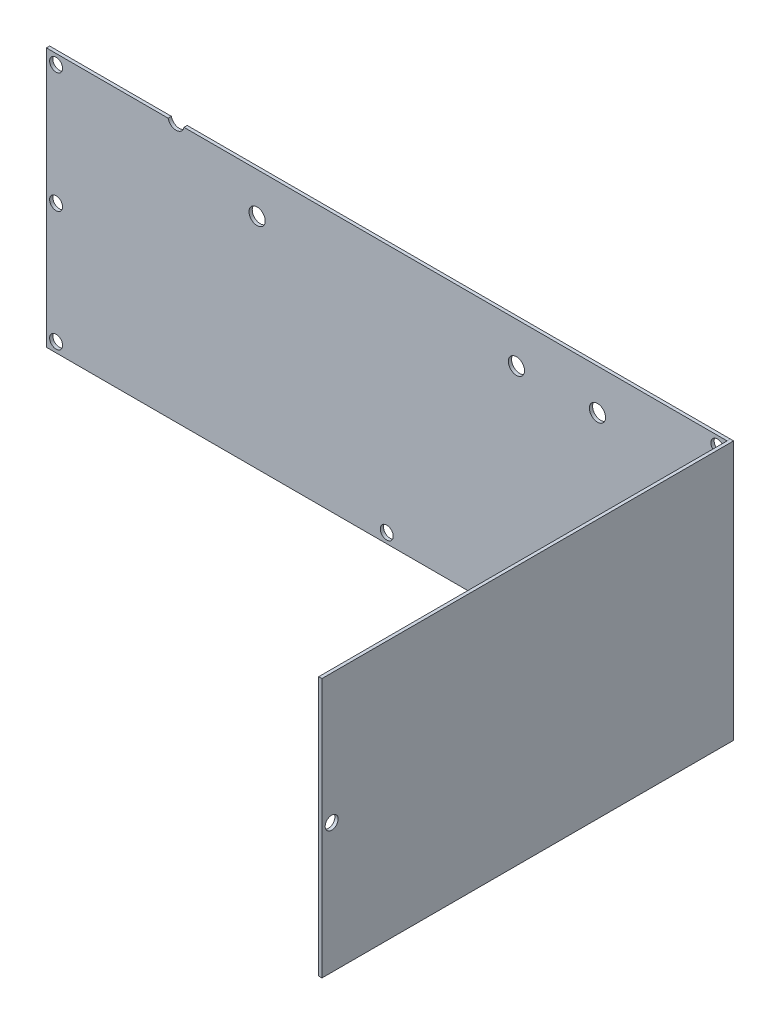
ISO-10303-21;
HEADER;
FILE_DESCRIPTION(('STEP AP214'),'2;1');
FILE_NAME('part.step','',(''),(''),'','','');
FILE_SCHEMA(('AUTOMOTIVE_DESIGN { 1 0 10303 214 1 1 1 1 }'));
ENDSEC;
DATA;
#1=APPLICATION_CONTEXT('core data for automotive mechanical design processes');
#2=APPLICATION_PROTOCOL_DEFINITION('international standard','automotive_design',2000,#1);
#3=PRODUCT_CONTEXT('',#1,'mechanical');
#4=PRODUCT('Part','Part','',(#3));
#5=PRODUCT_RELATED_PRODUCT_CATEGORY('part','',(#4));
#6=PRODUCT_DEFINITION_FORMATION('','',#4);
#7=PRODUCT_DEFINITION_CONTEXT('part definition',#1,'design');
#8=PRODUCT_DEFINITION('design','',#6,#7);
#9=PRODUCT_DEFINITION_SHAPE('','',#8);
#10=(LENGTH_UNIT() NAMED_UNIT(*) SI_UNIT(.MILLI.,.METRE.));
#11=(NAMED_UNIT(*) PLANE_ANGLE_UNIT() SI_UNIT($,.RADIAN.));
#12=(NAMED_UNIT(*) SI_UNIT($,.STERADIAN.) SOLID_ANGLE_UNIT());
#13=UNCERTAINTY_MEASURE_WITH_UNIT(LENGTH_MEASURE(1.E-05),#10,'distance_accuracy_value','');
#14=(GEOMETRIC_REPRESENTATION_CONTEXT(3) GLOBAL_UNCERTAINTY_ASSIGNED_CONTEXT((#13)) GLOBAL_UNIT_ASSIGNED_CONTEXT((#10,
#11,#12)) REPRESENTATION_CONTEXT('',''));
#15=CARTESIAN_POINT('',(0.,0.,0.));
#16=DIRECTION('',(0.,0.,1.));
#17=DIRECTION('',(1.,0.,0.));
#18=AXIS2_PLACEMENT_3D('',#15,#16,#17);
#19=CARTESIAN_POINT('',(105.,40.,0.));
#20=DIRECTION('',(-1.,0.,0.));
#21=DIRECTION('',(0.,-1.,0.));
#22=AXIS2_PLACEMENT_3D('',#19,#20,#21);
#23=PLANE('',#22);
#24=CARTESIAN_POINT('',(105.,0.,124.));
#25=DIRECTION('',(-1.,0.,0.));
#26=DIRECTION('',(0.,-1.,0.));
#27=AXIS2_PLACEMENT_3D('',#24,#25,#26);
#28=CIRCLE('',#27,2.);
#29=CARTESIAN_POINT('',(105.,-2.00000000000003,124.));
#30=VERTEX_POINT('',#29);
#31=EDGE_CURVE('E101',#30,#30,#28,.T.);
#32=ORIENTED_EDGE('',*,*,#31,.F.);
#33=EDGE_LOOP('',(#32));
#34=FACE_BOUND('',#33,.T.);
#35=DIRECTION('',(0.,0.,1.));
#36=VECTOR('',#35,1.);
#37=CARTESIAN_POINT('',(105.,-40.,0.));
#38=LINE('',#37,#36);
#39=CARTESIAN_POINT('',(105.,-40.,0.));
#40=VERTEX_POINT('',#39);
#41=CARTESIAN_POINT('',(105.,-40.,127.));
#42=VERTEX_POINT('',#41);
#43=EDGE_CURVE('E46',#40,#42,#38,.T.);
#44=ORIENTED_EDGE('',*,*,#43,.T.);
#45=DIRECTION('',(0.,-1.,0.));
#46=VECTOR('',#45,1.);
#47=CARTESIAN_POINT('',(105.,40.,127.));
#48=LINE('',#47,#46);
#49=CARTESIAN_POINT('',(105.,40.,127.));
#50=VERTEX_POINT('',#49);
#51=EDGE_CURVE('E83',#50,#42,#48,.T.);
#52=ORIENTED_EDGE('',*,*,#51,.F.);
#53=DIRECTION('',(0.,0.,1.));
#54=VECTOR('',#53,1.);
#55=CARTESIAN_POINT('',(105.,40.,0.));
#56=LINE('',#55,#54);
#57=CARTESIAN_POINT('',(105.,40.,0.));
#58=VERTEX_POINT('',#57);
#59=EDGE_CURVE('E12',#58,#50,#56,.T.);
#60=ORIENTED_EDGE('',*,*,#59,.F.);
#61=DIRECTION('',(0.,-1.,0.));
#62=VECTOR('',#61,1.);
#63=CARTESIAN_POINT('',(105.,40.,0.));
#64=LINE('',#63,#62);
#65=EDGE_CURVE('E84',#58,#40,#64,.T.);
#66=ORIENTED_EDGE('',*,*,#65,.T.);
#67=EDGE_LOOP('',(#44,#52,#60,#66));
#68=FACE_BOUND('',#67,.T.);
#69=ADVANCED_FACE('F43',(#34,#68),#23,.T.);
#70=CARTESIAN_POINT('',(105.,40.,0.));
#71=DIRECTION('',(0.,1.,0.));
#72=DIRECTION('',(0.,0.,1.));
#73=AXIS2_PLACEMENT_3D('',#70,#71,#72);
#74=PLANE('',#73);
#75=ORIENTED_EDGE('',*,*,#59,.T.);
#76=DIRECTION('',(-1.,0.,0.));
#77=VECTOR('',#76,1.);
#78=CARTESIAN_POINT('',(105.,40.,127.));
#79=LINE('',#78,#77);
#80=CARTESIAN_POINT('',(106.,40.,127.));
#81=VERTEX_POINT('',#80);
#82=EDGE_CURVE('E100',#81,#50,#79,.T.);
#83=ORIENTED_EDGE('',*,*,#82,.F.);
#84=DIRECTION('',(0.,0.,1.));
#85=VECTOR('',#84,1.);
#86=CARTESIAN_POINT('',(106.,40.,0.));
#87=LINE('',#86,#85);
#88=CARTESIAN_POINT('',(106.,40.,0.));
#89=VERTEX_POINT('',#88);
#90=EDGE_CURVE('E51',#89,#81,#87,.T.);
#91=ORIENTED_EDGE('',*,*,#90,.F.);
#92=DIRECTION('',(-1.,0.,0.));
#93=VECTOR('',#92,1.);
#94=CARTESIAN_POINT('',(105.,40.,0.));
#95=LINE('',#94,#93);
#96=EDGE_CURVE('E89',#89,#58,#95,.T.);
#97=ORIENTED_EDGE('',*,*,#96,.T.);
#98=EDGE_LOOP('',(#75,#83,#91,#97));
#99=FACE_BOUND('',#98,.T.);
#100=ADVANCED_FACE('F120',(#99),#74,.T.);
#101=CARTESIAN_POINT('',(106.,40.,0.));
#102=DIRECTION('',(1.,0.,0.));
#103=DIRECTION('',(0.,0.,-1.));
#104=AXIS2_PLACEMENT_3D('',#101,#102,#103);
#105=PLANE('',#104);
#106=CARTESIAN_POINT('',(106.,0.,124.));
#107=DIRECTION('',(1.,0.,0.));
#108=DIRECTION('',(0.,1.,0.));
#109=AXIS2_PLACEMENT_3D('',#106,#107,#108);
#110=CIRCLE('',#109,2.);
#111=CARTESIAN_POINT('',(106.,1.99999999999996,124.));
#112=VERTEX_POINT('',#111);
#113=EDGE_CURVE('E104',#112,#112,#110,.T.);
#114=ORIENTED_EDGE('',*,*,#113,.F.);
#115=EDGE_LOOP('',(#114));
#116=FACE_BOUND('',#115,.T.);
#117=ORIENTED_EDGE('',*,*,#90,.T.);
#118=DIRECTION('',(0.,1.,0.));
#119=VECTOR('',#118,1.);
#120=CARTESIAN_POINT('',(106.,40.,127.));
#121=LINE('',#120,#119);
#122=CARTESIAN_POINT('',(106.,-40.,127.));
#123=VERTEX_POINT('',#122);
#124=EDGE_CURVE('E96',#123,#81,#121,.T.);
#125=ORIENTED_EDGE('',*,*,#124,.F.);
#126=DIRECTION('',(0.,0.,1.));
#127=VECTOR('',#126,1.);
#128=CARTESIAN_POINT('',(106.,-40.,0.));
#129=LINE('',#128,#127);
#130=CARTESIAN_POINT('',(106.,-40.,0.));
#131=VERTEX_POINT('',#130);
#132=EDGE_CURVE('E88',#131,#123,#129,.T.);
#133=ORIENTED_EDGE('',*,*,#132,.F.);
#134=DIRECTION('',(0.,1.,0.));
#135=VECTOR('',#134,1.);
#136=CARTESIAN_POINT('',(106.,40.,0.));
#137=LINE('',#136,#135);
#138=EDGE_CURVE('E113',#131,#89,#137,.T.);
#139=ORIENTED_EDGE('',*,*,#138,.T.);
#140=EDGE_LOOP('',(#117,#125,#133,#139));
#141=FACE_BOUND('',#140,.T.);
#142=ADVANCED_FACE('F117',(#116,#141),#105,.T.);
#143=CARTESIAN_POINT('',(105.,-40.,0.));
#144=DIRECTION('',(0.,-1.,0.));
#145=DIRECTION('',(0.,0.,-1.));
#146=AXIS2_PLACEMENT_3D('',#143,#144,#145);
#147=PLANE('',#146);
#148=ORIENTED_EDGE('',*,*,#132,.T.);
#149=DIRECTION('',(1.,0.,0.));
#150=VECTOR('',#149,1.);
#151=CARTESIAN_POINT('',(105.,-40.,127.));
#152=LINE('',#151,#150);
#153=EDGE_CURVE('E91',#42,#123,#152,.T.);
#154=ORIENTED_EDGE('',*,*,#153,.F.);
#155=ORIENTED_EDGE('',*,*,#43,.F.);
#156=DIRECTION('',(1.,0.,0.));
#157=VECTOR('',#156,1.);
#158=CARTESIAN_POINT('',(105.,-40.,0.));
#159=LINE('',#158,#157);
#160=EDGE_CURVE('E111',#40,#131,#159,.T.);
#161=ORIENTED_EDGE('',*,*,#160,.T.);
#162=EDGE_LOOP('',(#148,#154,#155,#161));
#163=FACE_BOUND('',#162,.T.);
#164=ADVANCED_FACE('F92',(#163),#147,.T.);
#165=CARTESIAN_POINT('',(0.,0.,0.));
#166=DIRECTION('',(0.,0.,1.));
#167=DIRECTION('',(1.,0.,0.));
#168=AXIS2_PLACEMENT_3D('',#165,#166,#167);
#169=PLANE('',#168);
#170=ORIENTED_EDGE('',*,*,#65,.F.);
#171=ORIENTED_EDGE('',*,*,#96,.F.);
#172=ORIENTED_EDGE('',*,*,#138,.F.);
#173=ORIENTED_EDGE('',*,*,#160,.F.);
#174=EDGE_LOOP('',(#170,#171,#172,#173));
#175=FACE_BOUND('',#174,.T.);
#176=ADVANCED_FACE('F122',(#175),#169,.F.);
#177=CARTESIAN_POINT('',(0.,0.,127.));
#178=DIRECTION('',(0.,0.,1.));
#179=DIRECTION('',(1.,0.,0.));
#180=AXIS2_PLACEMENT_3D('',#177,#178,#179);
#181=PLANE('',#180);
#182=ORIENTED_EDGE('',*,*,#51,.T.);
#183=ORIENTED_EDGE('',*,*,#153,.T.);
#184=ORIENTED_EDGE('',*,*,#124,.T.);
#185=ORIENTED_EDGE('',*,*,#82,.T.);
#186=EDGE_LOOP('',(#182,#183,#184,#185));
#187=FACE_BOUND('',#186,.T.);
#188=ADVANCED_FACE('F99',(#187),#181,.T.);
#189=CARTESIAN_POINT('',(104.,0.,124.));
#190=DIRECTION('',(1.,0.,0.));
#191=DIRECTION('',(0.,1.,0.));
#192=AXIS2_PLACEMENT_3D('',#189,#190,#191);
#193=CYLINDRICAL_SURFACE('',#192,2.);
#194=ORIENTED_EDGE('',*,*,#31,.T.);
#195=EDGE_LOOP('',(#194));
#196=FACE_BOUND('',#195,.T.);
#197=ORIENTED_EDGE('',*,*,#113,.T.);
#198=EDGE_LOOP('',(#197));
#199=FACE_BOUND('',#198,.T.);
#200=ADVANCED_FACE('F129',(#196,#199),#193,.F.);
#201=CLOSED_SHELL('',(#69,#100,#142,#164,#176,#188,#200));
#202=MANIFOLD_SOLID_BREP('B2',#201);
#203=CARTESIAN_POINT('',(-105.,40.,1.));
#204=DIRECTION('',(0.,-1.,0.));
#205=DIRECTION('',(0.,0.,-1.));
#206=AXIS2_PLACEMENT_3D('',#203,#204,#205);
#207=PLANE('',#206);
#208=DIRECTION('',(-1.,0.,0.));
#209=VECTOR('',#208,1.);
#210=CARTESIAN_POINT('',(-105.,40.,1.));
#211=LINE('',#210,#209);
#212=CARTESIAN_POINT('',(-67.4494897427832,40.,1.));
#213=VERTEX_POINT('',#212);
#214=CARTESIAN_POINT('',(-105.,40.,1.));
#215=VERTEX_POINT('',#214);
#216=EDGE_CURVE('E212',#213,#215,#211,.T.);
#217=ORIENTED_EDGE('',*,*,#216,.F.);
#218=DIRECTION('',(0.,0.,-1.));
#219=VECTOR('',#218,1.);
#220=CARTESIAN_POINT('',(-67.4494897427832,40.,2.));
#221=LINE('',#220,#219);
#222=CARTESIAN_POINT('',(-67.4494897427832,40.,0.));
#223=VERTEX_POINT('',#222);
#224=EDGE_CURVE('E250',#213,#223,#221,.T.);
#225=ORIENTED_EDGE('',*,*,#224,.T.);
#226=DIRECTION('',(-1.,0.,0.));
#227=VECTOR('',#226,1.);
#228=CARTESIAN_POINT('',(-105.,40.,0.));
#229=LINE('',#228,#227);
#230=CARTESIAN_POINT('',(-105.,40.,0.));
#231=VERTEX_POINT('',#230);
#232=EDGE_CURVE('E234',#223,#231,#229,.T.);
#233=ORIENTED_EDGE('',*,*,#232,.T.);
#234=DIRECTION('',(0.,0.,-1.));
#235=VECTOR('',#234,1.);
#236=CARTESIAN_POINT('',(-105.,40.,1.));
#237=LINE('',#236,#235);
#238=EDGE_CURVE('E271',#215,#231,#237,.T.);
#239=ORIENTED_EDGE('',*,*,#238,.F.);
#240=EDGE_LOOP('',(#217,#225,#233,#239));
#241=FACE_BOUND('',#240,.T.);
#242=ADVANCED_FACE('F188',(#241),#207,.F.);
#243=CARTESIAN_POINT('',(-105.,-40.,1.));
#244=DIRECTION('',(1.,0.,0.));
#245=DIRECTION('',(0.,0.,-1.));
#246=AXIS2_PLACEMENT_3D('',#243,#244,#245);
#247=PLANE('',#246);
#248=DIRECTION('',(0.,-1.,0.));
#249=VECTOR('',#248,1.);
#250=CARTESIAN_POINT('',(-105.,-40.,0.));
#251=LINE('',#250,#249);
#252=CARTESIAN_POINT('',(-105.,-40.,0.));
#253=VERTEX_POINT('',#252);
#254=EDGE_CURVE('E262',#231,#253,#251,.T.);
#255=ORIENTED_EDGE('',*,*,#254,.T.);
#256=DIRECTION('',(0.,0.,-1.));
#257=VECTOR('',#256,1.);
#258=CARTESIAN_POINT('',(-105.,-40.,1.));
#259=LINE('',#258,#257);
#260=CARTESIAN_POINT('',(-105.,-40.,1.));
#261=VERTEX_POINT('',#260);
#262=EDGE_CURVE('E41',#261,#253,#259,.T.);
#263=ORIENTED_EDGE('',*,*,#262,.F.);
#264=DIRECTION('',(0.,-1.,0.));
#265=VECTOR('',#264,1.);
#266=CARTESIAN_POINT('',(-105.,-40.,1.));
#267=LINE('',#266,#265);
#268=EDGE_CURVE('E266',#215,#261,#267,.T.);
#269=ORIENTED_EDGE('',*,*,#268,.F.);
#270=ORIENTED_EDGE('',*,*,#238,.T.);
#271=EDGE_LOOP('',(#255,#263,#269,#270));
#272=FACE_BOUND('',#271,.T.);
#273=ADVANCED_FACE('F190',(#272),#247,.F.);
#274=CARTESIAN_POINT('',(-105.,-40.,1.));
#275=DIRECTION('',(0.,1.,0.));
#276=DIRECTION('',(0.,0.,1.));
#277=AXIS2_PLACEMENT_3D('',#274,#275,#276);
#278=PLANE('',#277);
#279=DIRECTION('',(1.,0.,0.));
#280=VECTOR('',#279,1.);
#281=CARTESIAN_POINT('',(-105.,-40.,0.));
#282=LINE('',#281,#280);
#283=CARTESIAN_POINT('',(105.,-40.,0.));
#284=VERTEX_POINT('',#283);
#285=EDGE_CURVE('E267',#253,#284,#282,.T.);
#286=ORIENTED_EDGE('',*,*,#285,.T.);
#287=DIRECTION('',(0.,0.,-1.));
#288=VECTOR('',#287,1.);
#289=CARTESIAN_POINT('',(105.,-40.,1.));
#290=LINE('',#289,#288);
#291=CARTESIAN_POINT('',(105.,-40.,1.));
#292=VERTEX_POINT('',#291);
#293=EDGE_CURVE('E196',#292,#284,#290,.T.);
#294=ORIENTED_EDGE('',*,*,#293,.F.);
#295=DIRECTION('',(1.,0.,0.));
#296=VECTOR('',#295,1.);
#297=CARTESIAN_POINT('',(-105.,-40.,1.));
#298=LINE('',#297,#296);
#299=EDGE_CURVE('E241',#261,#292,#298,.T.);
#300=ORIENTED_EDGE('',*,*,#299,.F.);
#301=ORIENTED_EDGE('',*,*,#262,.T.);
#302=EDGE_LOOP('',(#286,#294,#300,#301));
#303=FACE_BOUND('',#302,.T.);
#304=ADVANCED_FACE('F292',(#303),#278,.F.);
#305=CARTESIAN_POINT('',(105.,-40.,1.));
#306=DIRECTION('',(-1.,0.,0.));
#307=DIRECTION('',(0.,-1.,0.));
#308=AXIS2_PLACEMENT_3D('',#305,#306,#307);
#309=PLANE('',#308);
#310=DIRECTION('',(0.,1.,0.));
#311=VECTOR('',#310,1.);
#312=CARTESIAN_POINT('',(105.,-40.,0.));
#313=LINE('',#312,#311);
#314=CARTESIAN_POINT('',(105.,40.,0.));
#315=VERTEX_POINT('',#314);
#316=EDGE_CURVE('E264',#284,#315,#313,.T.);
#317=ORIENTED_EDGE('',*,*,#316,.T.);
#318=DIRECTION('',(0.,0.,-1.));
#319=VECTOR('',#318,1.);
#320=CARTESIAN_POINT('',(105.,40.,1.));
#321=LINE('',#320,#319);
#322=CARTESIAN_POINT('',(105.,40.,1.));
#323=VERTEX_POINT('',#322);
#324=EDGE_CURVE('E273',#323,#315,#321,.T.);
#325=ORIENTED_EDGE('',*,*,#324,.F.);
#326=DIRECTION('',(0.,1.,0.));
#327=VECTOR('',#326,1.);
#328=CARTESIAN_POINT('',(105.,-40.,1.));
#329=LINE('',#328,#327);
#330=EDGE_CURVE('E282',#292,#323,#329,.T.);
#331=ORIENTED_EDGE('',*,*,#330,.F.);
#332=ORIENTED_EDGE('',*,*,#293,.T.);
#333=EDGE_LOOP('',(#317,#325,#331,#332));
#334=FACE_BOUND('',#333,.T.);
#335=ADVANCED_FACE('F280',(#334),#309,.F.);
#336=CARTESIAN_POINT('',(-62.5505102572168,40.,0.));
#337=VERTEX_POINT('',#336);
#338=EDGE_CURVE('E263',#315,#337,#229,.T.);
#339=ORIENTED_EDGE('',*,*,#338,.T.);
#340=DIRECTION('',(0.,0.,-1.));
#341=VECTOR('',#340,1.);
#342=CARTESIAN_POINT('',(-62.5505102572168,40.,2.));
#343=LINE('',#342,#341);
#344=CARTESIAN_POINT('',(-62.5505102572168,40.,1.));
#345=VERTEX_POINT('',#344);
#346=EDGE_CURVE('E203',#337,#345,#343,.F.);
#347=ORIENTED_EDGE('',*,*,#346,.T.);
#348=EDGE_CURVE('E274',#323,#345,#211,.T.);
#349=ORIENTED_EDGE('',*,*,#348,.F.);
#350=ORIENTED_EDGE('',*,*,#324,.T.);
#351=EDGE_LOOP('',(#339,#347,#349,#350));
#352=FACE_BOUND('',#351,.T.);
#353=ADVANCED_FACE('F284',(#352),#207,.F.);
#354=CARTESIAN_POINT('',(0.,0.,1.));
#355=DIRECTION('',(0.,0.,-1.));
#356=DIRECTION('',(-1.,0.,0.));
#357=AXIS2_PLACEMENT_3D('',#354,#355,#356);
#358=PLANE('',#357);
#359=CARTESIAN_POINT('',(-40.,27.5,1.));
#360=DIRECTION('',(0.,0.,-1.));
#361=DIRECTION('',(-1.,0.,0.));
#362=AXIS2_PLACEMENT_3D('',#359,#360,#361);
#363=CIRCLE('',#362,2.5);
#364=CARTESIAN_POINT('',(-42.5,27.5,1.));
#365=VERTEX_POINT('',#364);
#366=EDGE_CURVE('E345',#365,#365,#363,.T.);
#367=ORIENTED_EDGE('',*,*,#366,.T.);
#368=EDGE_LOOP('',(#367));
#369=FACE_BOUND('',#368,.T.);
#370=CARTESIAN_POINT('',(40.,27.5,1.));
#371=DIRECTION('',(0.,0.,-1.));
#372=DIRECTION('',(-1.,0.,0.));
#373=AXIS2_PLACEMENT_3D('',#370,#371,#372);
#374=CIRCLE('',#373,2.5);
#375=CARTESIAN_POINT('',(37.5,27.5,1.));
#376=VERTEX_POINT('',#375);
#377=EDGE_CURVE('E339',#376,#376,#374,.T.);
#378=ORIENTED_EDGE('',*,*,#377,.T.);
#379=EDGE_LOOP('',(#378));
#380=FACE_BOUND('',#379,.T.);
#381=CARTESIAN_POINT('',(65.,27.5,1.));
#382=DIRECTION('',(0.,0.,-1.));
#383=DIRECTION('',(-1.,0.,0.));
#384=AXIS2_PLACEMENT_3D('',#381,#382,#383);
#385=CIRCLE('',#384,2.49999999999999);
#386=CARTESIAN_POINT('',(62.5,27.5,1.));
#387=VERTEX_POINT('',#386);
#388=EDGE_CURVE('E333',#387,#387,#385,.T.);
#389=ORIENTED_EDGE('',*,*,#388,.T.);
#390=EDGE_LOOP('',(#389));
#391=FACE_BOUND('',#390,.T.);
#392=CARTESIAN_POINT('',(102.,-37.,1.));
#393=DIRECTION('',(0.,0.,-1.));
#394=DIRECTION('',(-1.,0.,0.));
#395=AXIS2_PLACEMENT_3D('',#392,#393,#394);
#396=CIRCLE('',#395,2.);
#397=CARTESIAN_POINT('',(100.,-37.,1.));
#398=VERTEX_POINT('',#397);
#399=EDGE_CURVE('E327',#398,#398,#396,.T.);
#400=ORIENTED_EDGE('',*,*,#399,.T.);
#401=EDGE_LOOP('',(#400));
#402=FACE_BOUND('',#401,.T.);
#403=CARTESIAN_POINT('',(0.,-37.,1.));
#404=DIRECTION('',(0.,0.,-1.));
#405=DIRECTION('',(-1.,0.,0.));
#406=AXIS2_PLACEMENT_3D('',#403,#404,#405);
#407=CIRCLE('',#406,2.);
#408=CARTESIAN_POINT('',(-2.00000000000002,-37.,1.));
#409=VERTEX_POINT('',#408);
#410=EDGE_CURVE('E321',#409,#409,#407,.T.);
#411=ORIENTED_EDGE('',*,*,#410,.T.);
#412=EDGE_LOOP('',(#411));
#413=FACE_BOUND('',#412,.T.);
#414=CARTESIAN_POINT('',(102.,37.,1.));
#415=DIRECTION('',(0.,0.,-1.));
#416=DIRECTION('',(-1.,0.,0.));
#417=AXIS2_PLACEMENT_3D('',#414,#415,#416);
#418=CIRCLE('',#417,2.);
#419=CARTESIAN_POINT('',(99.9999999999999,37.,1.));
#420=VERTEX_POINT('',#419);
#421=EDGE_CURVE('E315',#420,#420,#418,.T.);
#422=ORIENTED_EDGE('',*,*,#421,.T.);
#423=EDGE_LOOP('',(#422));
#424=FACE_BOUND('',#423,.T.);
#425=CARTESIAN_POINT('',(-102.,-37.,1.));
#426=DIRECTION('',(0.,0.,-1.));
#427=DIRECTION('',(-1.,0.,0.));
#428=AXIS2_PLACEMENT_3D('',#425,#426,#427);
#429=CIRCLE('',#428,2.);
#430=CARTESIAN_POINT('',(-104.,-37.,1.));
#431=VERTEX_POINT('',#430);
#432=EDGE_CURVE('E309',#431,#431,#429,.T.);
#433=ORIENTED_EDGE('',*,*,#432,.T.);
#434=EDGE_LOOP('',(#433));
#435=FACE_BOUND('',#434,.T.);
#436=CARTESIAN_POINT('',(-102.,37.,1.));
#437=DIRECTION('',(0.,0.,-1.));
#438=DIRECTION('',(-1.,0.,0.));
#439=AXIS2_PLACEMENT_3D('',#436,#437,#438);
#440=CIRCLE('',#439,2.);
#441=CARTESIAN_POINT('',(-104.,37.,1.));
#442=VERTEX_POINT('',#441);
#443=EDGE_CURVE('E303',#442,#442,#440,.T.);
#444=ORIENTED_EDGE('',*,*,#443,.T.);
#445=EDGE_LOOP('',(#444));
#446=FACE_BOUND('',#445,.T.);
#447=CARTESIAN_POINT('',(-102.,0.,1.));
#448=DIRECTION('',(0.,0.,-1.));
#449=DIRECTION('',(-1.,0.,0.));
#450=AXIS2_PLACEMENT_3D('',#447,#448,#449);
#451=CIRCLE('',#450,2.);
#452=CARTESIAN_POINT('',(-104.,0.,1.));
#453=VERTEX_POINT('',#452);
#454=EDGE_CURVE('E291',#453,#453,#451,.T.);
#455=ORIENTED_EDGE('',*,*,#454,.T.);
#456=EDGE_LOOP('',(#455));
#457=FACE_BOUND('',#456,.T.);
#458=ORIENTED_EDGE('',*,*,#348,.T.);
#459=CARTESIAN_POINT('',(-65.,40.5,1.));
#460=DIRECTION('',(0.,0.,-1.));
#461=DIRECTION('',(-1.,0.,0.));
#462=AXIS2_PLACEMENT_3D('',#459,#460,#461);
#463=CIRCLE('',#462,2.5);
#464=EDGE_CURVE('E254',#345,#213,#463,.T.);
#465=ORIENTED_EDGE('',*,*,#464,.T.);
#466=ORIENTED_EDGE('',*,*,#216,.T.);
#467=ORIENTED_EDGE('',*,*,#268,.T.);
#468=ORIENTED_EDGE('',*,*,#299,.T.);
#469=ORIENTED_EDGE('',*,*,#330,.T.);
#470=EDGE_LOOP('',(#458,#465,#466,#467,#468,#469));
#471=FACE_BOUND('',#470,.T.);
#472=ADVANCED_FACE('F351',(#369,#380,#391,#402,#413,#424,#435,#446,#457,#471),#358,.F.);
#473=CARTESIAN_POINT('',(0.,0.,0.));
#474=DIRECTION('',(0.,0.,-1.));
#475=DIRECTION('',(-1.,0.,0.));
#476=AXIS2_PLACEMENT_3D('',#473,#474,#475);
#477=PLANE('',#476);
#478=CARTESIAN_POINT('',(-65.,40.5,0.));
#479=DIRECTION('',(0.,0.,-1.));
#480=DIRECTION('',(1.,0.,0.));
#481=AXIS2_PLACEMENT_3D('',#478,#479,#480);
#482=CIRCLE('',#481,2.5);
#483=EDGE_CURVE('E248',#337,#223,#482,.T.);
#484=ORIENTED_EDGE('',*,*,#483,.F.);
#485=ORIENTED_EDGE('',*,*,#338,.F.);
#486=ORIENTED_EDGE('',*,*,#316,.F.);
#487=ORIENTED_EDGE('',*,*,#285,.F.);
#488=ORIENTED_EDGE('',*,*,#254,.F.);
#489=ORIENTED_EDGE('',*,*,#232,.F.);
#490=EDGE_LOOP('',(#484,#485,#486,#487,#488,#489));
#491=FACE_BOUND('',#490,.T.);
#492=CARTESIAN_POINT('',(-40.,27.5,0.));
#493=DIRECTION('',(0.,0.,-1.));
#494=DIRECTION('',(1.,0.,0.));
#495=AXIS2_PLACEMENT_3D('',#492,#493,#494);
#496=CIRCLE('',#495,2.5);
#497=CARTESIAN_POINT('',(-37.5,27.5,0.));
#498=VERTEX_POINT('',#497);
#499=EDGE_CURVE('E256',#498,#498,#496,.T.);
#500=ORIENTED_EDGE('',*,*,#499,.F.);
#501=EDGE_LOOP('',(#500));
#502=FACE_BOUND('',#501,.T.);
#503=CARTESIAN_POINT('',(40.,27.5,0.));
#504=DIRECTION('',(0.,0.,-1.));
#505=DIRECTION('',(-1.,0.,0.));
#506=AXIS2_PLACEMENT_3D('',#503,#504,#505);
#507=CIRCLE('',#506,2.5);
#508=CARTESIAN_POINT('',(37.5,27.5,0.));
#509=VERTEX_POINT('',#508);
#510=EDGE_CURVE('E342',#509,#509,#507,.T.);
#511=ORIENTED_EDGE('',*,*,#510,.F.);
#512=EDGE_LOOP('',(#511));
#513=FACE_BOUND('',#512,.T.);
#514=CARTESIAN_POINT('',(65.,27.5,0.));
#515=DIRECTION('',(0.,0.,-1.));
#516=DIRECTION('',(-1.,0.,0.));
#517=AXIS2_PLACEMENT_3D('',#514,#515,#516);
#518=CIRCLE('',#517,2.49999999999999);
#519=CARTESIAN_POINT('',(62.5,27.5,0.));
#520=VERTEX_POINT('',#519);
#521=EDGE_CURVE('E336',#520,#520,#518,.T.);
#522=ORIENTED_EDGE('',*,*,#521,.F.);
#523=EDGE_LOOP('',(#522));
#524=FACE_BOUND('',#523,.T.);
#525=CARTESIAN_POINT('',(102.,-37.,0.));
#526=DIRECTION('',(0.,0.,-1.));
#527=DIRECTION('',(1.,0.,0.));
#528=AXIS2_PLACEMENT_3D('',#525,#526,#527);
#529=CIRCLE('',#528,2.);
#530=CARTESIAN_POINT('',(104.,-37.,0.));
#531=VERTEX_POINT('',#530);
#532=EDGE_CURVE('E330',#531,#531,#529,.T.);
#533=ORIENTED_EDGE('',*,*,#532,.F.);
#534=EDGE_LOOP('',(#533));
#535=FACE_BOUND('',#534,.T.);
#536=CARTESIAN_POINT('',(0.,-37.,0.));
#537=DIRECTION('',(0.,0.,-1.));
#538=DIRECTION('',(1.,0.,0.));
#539=AXIS2_PLACEMENT_3D('',#536,#537,#538);
#540=CIRCLE('',#539,2.);
#541=CARTESIAN_POINT('',(1.99999999999999,-37.,0.));
#542=VERTEX_POINT('',#541);
#543=EDGE_CURVE('E324',#542,#542,#540,.T.);
#544=ORIENTED_EDGE('',*,*,#543,.F.);
#545=EDGE_LOOP('',(#544));
#546=FACE_BOUND('',#545,.T.);
#547=CARTESIAN_POINT('',(102.,37.,0.));
#548=DIRECTION('',(0.,0.,-1.));
#549=DIRECTION('',(-1.,0.,0.));
#550=AXIS2_PLACEMENT_3D('',#547,#548,#549);
#551=CIRCLE('',#550,2.);
#552=CARTESIAN_POINT('',(99.9999999999999,37.,0.));
#553=VERTEX_POINT('',#552);
#554=EDGE_CURVE('E318',#553,#553,#551,.T.);
#555=ORIENTED_EDGE('',*,*,#554,.F.);
#556=EDGE_LOOP('',(#555));
#557=FACE_BOUND('',#556,.T.);
#558=CARTESIAN_POINT('',(-102.,-37.,0.));
#559=DIRECTION('',(0.,0.,-1.));
#560=DIRECTION('',(-1.,0.,0.));
#561=AXIS2_PLACEMENT_3D('',#558,#559,#560);
#562=CIRCLE('',#561,2.);
#563=CARTESIAN_POINT('',(-104.,-37.,0.));
#564=VERTEX_POINT('',#563);
#565=EDGE_CURVE('E312',#564,#564,#562,.T.);
#566=ORIENTED_EDGE('',*,*,#565,.F.);
#567=EDGE_LOOP('',(#566));
#568=FACE_BOUND('',#567,.T.);
#569=CARTESIAN_POINT('',(-102.,37.,0.));
#570=DIRECTION('',(0.,0.,-1.));
#571=DIRECTION('',(-1.,0.,0.));
#572=AXIS2_PLACEMENT_3D('',#569,#570,#571);
#573=CIRCLE('',#572,2.);
#574=CARTESIAN_POINT('',(-104.,37.,0.));
#575=VERTEX_POINT('',#574);
#576=EDGE_CURVE('E306',#575,#575,#573,.T.);
#577=ORIENTED_EDGE('',*,*,#576,.F.);
#578=EDGE_LOOP('',(#577));
#579=FACE_BOUND('',#578,.T.);
#580=CARTESIAN_POINT('',(-102.,0.,0.));
#581=DIRECTION('',(0.,0.,-1.));
#582=DIRECTION('',(-1.,0.,0.));
#583=AXIS2_PLACEMENT_3D('',#580,#581,#582);
#584=CIRCLE('',#583,2.);
#585=CARTESIAN_POINT('',(-104.,0.,0.));
#586=VERTEX_POINT('',#585);
#587=EDGE_CURVE('E300',#586,#586,#584,.T.);
#588=ORIENTED_EDGE('',*,*,#587,.F.);
#589=EDGE_LOOP('',(#588));
#590=FACE_BOUND('',#589,.T.);
#591=ADVANCED_FACE('F259',(#491,#502,#513,#524,#535,#546,#557,#568,#579,#590),#477,.T.);
#592=CARTESIAN_POINT('',(-102.,0.,2.));
#593=DIRECTION('',(0.,0.,-1.));
#594=DIRECTION('',(-1.,0.,0.));
#595=AXIS2_PLACEMENT_3D('',#592,#593,#594);
#596=CYLINDRICAL_SURFACE('',#595,2.);
#597=ORIENTED_EDGE('',*,*,#587,.T.);
#598=EDGE_LOOP('',(#597));
#599=FACE_BOUND('',#598,.T.);
#600=ORIENTED_EDGE('',*,*,#454,.F.);
#601=EDGE_LOOP('',(#600));
#602=FACE_BOUND('',#601,.T.);
#603=ADVANCED_FACE('F359',(#599,#602),#596,.F.);
#604=CARTESIAN_POINT('',(-102.,37.,2.));
#605=DIRECTION('',(0.,0.,-1.));
#606=DIRECTION('',(-1.,0.,0.));
#607=AXIS2_PLACEMENT_3D('',#604,#605,#606);
#608=CYLINDRICAL_SURFACE('',#607,2.);
#609=ORIENTED_EDGE('',*,*,#576,.T.);
#610=EDGE_LOOP('',(#609));
#611=FACE_BOUND('',#610,.T.);
#612=ORIENTED_EDGE('',*,*,#443,.F.);
#613=EDGE_LOOP('',(#612));
#614=FACE_BOUND('',#613,.T.);
#615=ADVANCED_FACE('F457',(#611,#614),#608,.F.);
#616=CARTESIAN_POINT('',(-102.,-37.,2.));
#617=DIRECTION('',(0.,0.,-1.));
#618=DIRECTION('',(-1.,0.,0.));
#619=AXIS2_PLACEMENT_3D('',#616,#617,#618);
#620=CYLINDRICAL_SURFACE('',#619,2.);
#621=ORIENTED_EDGE('',*,*,#565,.T.);
#622=EDGE_LOOP('',(#621));
#623=FACE_BOUND('',#622,.T.);
#624=ORIENTED_EDGE('',*,*,#432,.F.);
#625=EDGE_LOOP('',(#624));
#626=FACE_BOUND('',#625,.T.);
#627=ADVANCED_FACE('F453',(#623,#626),#620,.F.);
#628=CARTESIAN_POINT('',(102.,37.,2.));
#629=DIRECTION('',(0.,0.,-1.));
#630=DIRECTION('',(-1.,0.,0.));
#631=AXIS2_PLACEMENT_3D('',#628,#629,#630);
#632=CYLINDRICAL_SURFACE('',#631,2.);
#633=ORIENTED_EDGE('',*,*,#554,.T.);
#634=EDGE_LOOP('',(#633));
#635=FACE_BOUND('',#634,.T.);
#636=ORIENTED_EDGE('',*,*,#421,.F.);
#637=EDGE_LOOP('',(#636));
#638=FACE_BOUND('',#637,.T.);
#639=ADVANCED_FACE('F449',(#635,#638),#632,.F.);
#640=CARTESIAN_POINT('',(0.,-37.,2.));
#641=DIRECTION('',(0.,0.,-1.));
#642=DIRECTION('',(-1.,0.,0.));
#643=AXIS2_PLACEMENT_3D('',#640,#641,#642);
#644=CYLINDRICAL_SURFACE('',#643,2.);
#645=ORIENTED_EDGE('',*,*,#543,.T.);
#646=EDGE_LOOP('',(#645));
#647=FACE_BOUND('',#646,.T.);
#648=ORIENTED_EDGE('',*,*,#410,.F.);
#649=EDGE_LOOP('',(#648));
#650=FACE_BOUND('',#649,.T.);
#651=ADVANCED_FACE('F445',(#647,#650),#644,.F.);
#652=CARTESIAN_POINT('',(102.,-37.,2.));
#653=DIRECTION('',(0.,0.,-1.));
#654=DIRECTION('',(-1.,0.,0.));
#655=AXIS2_PLACEMENT_3D('',#652,#653,#654);
#656=CYLINDRICAL_SURFACE('',#655,2.);
#657=ORIENTED_EDGE('',*,*,#532,.T.);
#658=EDGE_LOOP('',(#657));
#659=FACE_BOUND('',#658,.T.);
#660=ORIENTED_EDGE('',*,*,#399,.F.);
#661=EDGE_LOOP('',(#660));
#662=FACE_BOUND('',#661,.T.);
#663=ADVANCED_FACE('F410',(#659,#662),#656,.F.);
#664=CARTESIAN_POINT('',(65.,27.5,2.));
#665=DIRECTION('',(0.,0.,-1.));
#666=DIRECTION('',(-1.,0.,0.));
#667=AXIS2_PLACEMENT_3D('',#664,#665,#666);
#668=CYLINDRICAL_SURFACE('',#667,2.49999999999999);
#669=ORIENTED_EDGE('',*,*,#521,.T.);
#670=EDGE_LOOP('',(#669));
#671=FACE_BOUND('',#670,.T.);
#672=ORIENTED_EDGE('',*,*,#388,.F.);
#673=EDGE_LOOP('',(#672));
#674=FACE_BOUND('',#673,.T.);
#675=ADVANCED_FACE('F404',(#671,#674),#668,.F.);
#676=CARTESIAN_POINT('',(40.,27.5,2.));
#677=DIRECTION('',(0.,0.,-1.));
#678=DIRECTION('',(-1.,0.,0.));
#679=AXIS2_PLACEMENT_3D('',#676,#677,#678);
#680=CYLINDRICAL_SURFACE('',#679,2.5);
#681=ORIENTED_EDGE('',*,*,#510,.T.);
#682=EDGE_LOOP('',(#681));
#683=FACE_BOUND('',#682,.T.);
#684=ORIENTED_EDGE('',*,*,#377,.F.);
#685=EDGE_LOOP('',(#684));
#686=FACE_BOUND('',#685,.T.);
#687=ADVANCED_FACE('F409',(#683,#686),#680,.F.);
#688=CARTESIAN_POINT('',(-40.,27.5,2.));
#689=DIRECTION('',(0.,0.,-1.));
#690=DIRECTION('',(-1.,0.,0.));
#691=AXIS2_PLACEMENT_3D('',#688,#689,#690);
#692=CYLINDRICAL_SURFACE('',#691,2.5);
#693=ORIENTED_EDGE('',*,*,#499,.T.);
#694=EDGE_LOOP('',(#693));
#695=FACE_BOUND('',#694,.T.);
#696=ORIENTED_EDGE('',*,*,#366,.F.);
#697=EDGE_LOOP('',(#696));
#698=FACE_BOUND('',#697,.T.);
#699=ADVANCED_FACE('F421',(#695,#698),#692,.F.);
#700=CARTESIAN_POINT('',(-65.,40.5,2.));
#701=DIRECTION('',(0.,0.,-1.));
#702=DIRECTION('',(-1.,0.,0.));
#703=AXIS2_PLACEMENT_3D('',#700,#701,#702);
#704=CYLINDRICAL_SURFACE('',#703,2.5);
#705=ORIENTED_EDGE('',*,*,#464,.F.);
#706=ORIENTED_EDGE('',*,*,#346,.F.);
#707=ORIENTED_EDGE('',*,*,#483,.T.);
#708=ORIENTED_EDGE('',*,*,#224,.F.);
#709=EDGE_LOOP('',(#705,#706,#707,#708));
#710=FACE_BOUND('',#709,.T.);
#711=ADVANCED_FACE('F249',(#710),#704,.F.);
#712=CLOSED_SHELL('',(#242,#273,#304,#335,#353,#472,#591,#603,#615,#627,#639,#651,#663,#675,
#687,#699,#711));
#713=MANIFOLD_SOLID_BREP('B6',#712);
#714=ADVANCED_BREP_SHAPE_REPRESENTATION('',(#18,#202,#713),#14);
#715=SHAPE_DEFINITION_REPRESENTATION(#9,#714);
ENDSEC;
END-ISO-10303-21;
